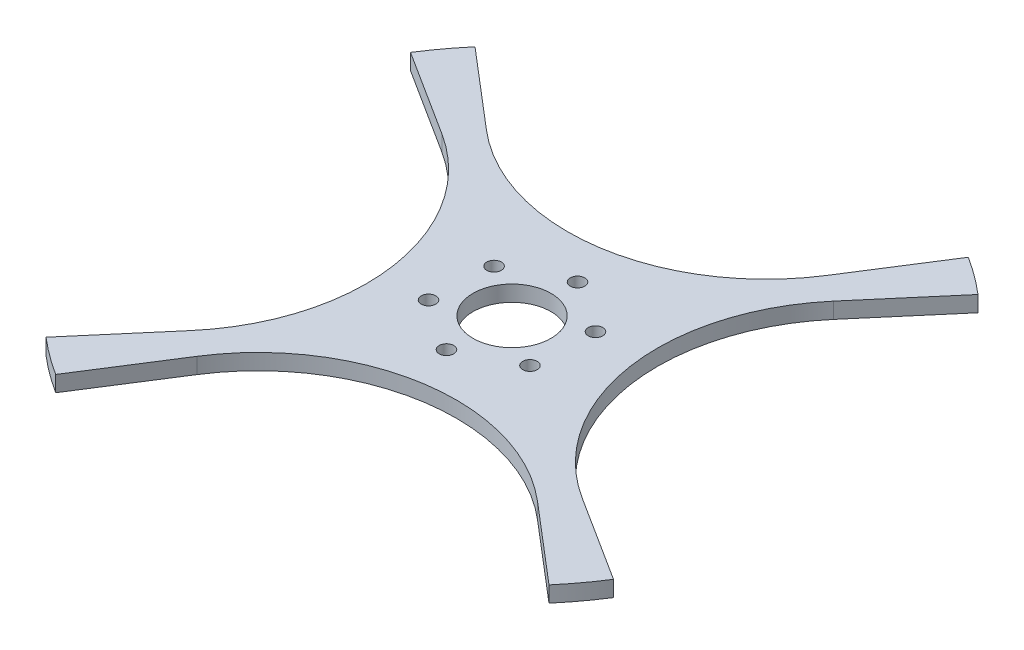
ISO-10303-21;
HEADER;
FILE_DESCRIPTION(('STEP AP214'),'2;1');
FILE_NAME('part.step','',(''),(''),'','','');
FILE_SCHEMA(('AUTOMOTIVE_DESIGN { 1 0 10303 214 1 1 1 1 }'));
ENDSEC;
DATA;
#1=APPLICATION_CONTEXT('core data for automotive mechanical design processes');
#2=APPLICATION_PROTOCOL_DEFINITION('international standard','automotive_design',2000,#1);
#3=PRODUCT_CONTEXT('',#1,'mechanical');
#4=PRODUCT('Part','Part','',(#3));
#5=PRODUCT_RELATED_PRODUCT_CATEGORY('part','',(#4));
#6=PRODUCT_DEFINITION_FORMATION('','',#4);
#7=PRODUCT_DEFINITION_CONTEXT('part definition',#1,'design');
#8=PRODUCT_DEFINITION('design','',#6,#7);
#9=PRODUCT_DEFINITION_SHAPE('','',#8);
#10=(LENGTH_UNIT() NAMED_UNIT(*) SI_UNIT(.MILLI.,.METRE.));
#11=(NAMED_UNIT(*) PLANE_ANGLE_UNIT() SI_UNIT($,.RADIAN.));
#12=(NAMED_UNIT(*) SI_UNIT($,.STERADIAN.) SOLID_ANGLE_UNIT());
#13=UNCERTAINTY_MEASURE_WITH_UNIT(LENGTH_MEASURE(1.E-05),#10,'distance_accuracy_value','');
#14=(GEOMETRIC_REPRESENTATION_CONTEXT(3) GLOBAL_UNCERTAINTY_ASSIGNED_CONTEXT((#13)) GLOBAL_UNIT_ASSIGNED_CONTEXT((#10,
#11,#12)) REPRESENTATION_CONTEXT('',''));
#15=CARTESIAN_POINT('',(0.,0.,0.));
#16=DIRECTION('',(0.,0.,1.));
#17=DIRECTION('',(1.,0.,0.));
#18=AXIS2_PLACEMENT_3D('',#15,#16,#17);
#19=CARTESIAN_POINT('',(0.,6.,0.));
#20=DIRECTION('',(0.,-1.,0.));
#21=DIRECTION('',(0.,0.,-1.));
#22=AXIS2_PLACEMENT_3D('',#19,#20,#21);
#23=CYLINDRICAL_SURFACE('',#22,125.);
#24=CARTESIAN_POINT('',(0.,6.,0.));
#25=DIRECTION('',(0.,1.,0.));
#26=DIRECTION('',(0.,0.,1.));
#27=AXIS2_PLACEMENT_3D('',#24,#25,#26);
#28=CIRCLE('',#27,125.);
#29=CARTESIAN_POINT('',(-95.1068903600789,6.,-81.1152230227836));
#30=VERTEX_POINT('',#29);
#31=CARTESIAN_POINT('',(-105.470373764041,6.,-67.0894943942311));
#32=VERTEX_POINT('',#31);
#33=EDGE_CURVE('E361',#30,#32,#28,.T.);
#34=ORIENTED_EDGE('',*,*,#33,.F.);
#35=DIRECTION('',(0.,1.,0.));
#36=VECTOR('',#35,1.);
#37=CARTESIAN_POINT('',(-95.1068903600789,0.,-81.1152230227836));
#38=LINE('',#37,#36);
#39=CARTESIAN_POINT('',(-95.1068903600789,0.,-81.1152230227836));
#40=VERTEX_POINT('',#39);
#41=EDGE_CURVE('E215',#40,#30,#38,.T.);
#42=ORIENTED_EDGE('',*,*,#41,.F.);
#43=CARTESIAN_POINT('',(0.,0.,0.));
#44=DIRECTION('',(0.,1.,0.));
#45=DIRECTION('',(0.,0.,1.));
#46=AXIS2_PLACEMENT_3D('',#43,#44,#45);
#47=CIRCLE('',#46,125.);
#48=CARTESIAN_POINT('',(-105.470373764041,0.,-67.0894943942311));
#49=VERTEX_POINT('',#48);
#50=EDGE_CURVE('E348',#40,#49,#47,.T.);
#51=ORIENTED_EDGE('',*,*,#50,.T.);
#52=DIRECTION('',(0.,1.,0.));
#53=VECTOR('',#52,1.);
#54=CARTESIAN_POINT('',(-105.470373764041,0.,-67.0894943942311));
#55=LINE('',#54,#53);
#56=EDGE_CURVE('E161',#49,#32,#55,.T.);
#57=ORIENTED_EDGE('',*,*,#56,.T.);
#58=EDGE_LOOP('',(#34,#42,#51,#57));
#59=FACE_BOUND('',#58,.T.);
#60=ADVANCED_FACE('F39',(#59),#23,.T.);
#61=CARTESIAN_POINT('',(-81.1152230227826,6.,95.1068903600798));
#62=VERTEX_POINT('',#61);
#63=CARTESIAN_POINT('',(-67.0894943942322,6.,105.47037376404));
#64=VERTEX_POINT('',#63);
#65=EDGE_CURVE('E49',#62,#64,#28,.T.);
#66=ORIENTED_EDGE('',*,*,#65,.F.);
#67=DIRECTION('',(0.,1.,0.));
#68=VECTOR('',#67,1.);
#69=CARTESIAN_POINT('',(-81.1152230227826,0.,95.1068903600798));
#70=LINE('',#69,#68);
#71=CARTESIAN_POINT('',(-81.1152230227826,0.,95.1068903600798));
#72=VERTEX_POINT('',#71);
#73=EDGE_CURVE('E188',#72,#62,#70,.T.);
#74=ORIENTED_EDGE('',*,*,#73,.F.);
#75=CARTESIAN_POINT('',(-67.0894943942322,0.,105.47037376404));
#76=VERTEX_POINT('',#75);
#77=EDGE_CURVE('E271',#72,#76,#47,.T.);
#78=ORIENTED_EDGE('',*,*,#77,.T.);
#79=DIRECTION('',(0.,1.,0.));
#80=VECTOR('',#79,1.);
#81=CARTESIAN_POINT('',(-67.0894943942322,0.,105.47037376404));
#82=LINE('',#81,#80);
#83=EDGE_CURVE('E268',#76,#64,#82,.T.);
#84=ORIENTED_EDGE('',*,*,#83,.T.);
#85=EDGE_LOOP('',(#66,#74,#78,#84));
#86=FACE_BOUND('',#85,.T.);
#87=ADVANCED_FACE('F312',(#86),#23,.T.);
#88=CARTESIAN_POINT('',(81.1152230227832,0.,-95.1068903600792));
#89=VERTEX_POINT('',#88);
#90=CARTESIAN_POINT('',(67.0894943942322,0.,-105.47037376404));
#91=VERTEX_POINT('',#90);
#92=EDGE_CURVE('E276',#89,#91,#47,.T.);
#93=ORIENTED_EDGE('',*,*,#92,.T.);
#94=DIRECTION('',(0.,1.,0.));
#95=VECTOR('',#94,1.);
#96=CARTESIAN_POINT('',(67.0894943942322,0.,-105.47037376404));
#97=LINE('',#96,#95);
#98=CARTESIAN_POINT('',(67.0894943942322,6.,-105.47037376404));
#99=VERTEX_POINT('',#98);
#100=EDGE_CURVE('E211',#91,#99,#97,.T.);
#101=ORIENTED_EDGE('',*,*,#100,.T.);
#102=CARTESIAN_POINT('',(81.1152230227832,6.,-95.1068903600792));
#103=VERTEX_POINT('',#102);
#104=EDGE_CURVE('E48',#103,#99,#28,.T.);
#105=ORIENTED_EDGE('',*,*,#104,.F.);
#106=DIRECTION('',(0.,1.,0.));
#107=VECTOR('',#106,1.);
#108=CARTESIAN_POINT('',(81.1152230227832,0.,-95.1068903600792));
#109=LINE('',#108,#107);
#110=EDGE_CURVE('E240',#89,#103,#109,.T.);
#111=ORIENTED_EDGE('',*,*,#110,.F.);
#112=EDGE_LOOP('',(#93,#101,#105,#111));
#113=FACE_BOUND('',#112,.T.);
#114=ADVANCED_FACE('F316',(#113),#23,.T.);
#115=CARTESIAN_POINT('',(0.,6.,0.));
#116=DIRECTION('',(0.,1.,0.));
#117=DIRECTION('',(0.,0.,1.));
#118=AXIS2_PLACEMENT_3D('',#115,#116,#117);
#119=PLANE('',#118);
#120=CARTESIAN_POINT('',(-1.31342881130652,6.,23.4632671372269));
#121=DIRECTION('',(0.,1.,0.));
#122=DIRECTION('',(0.,0.,1.));
#123=AXIS2_PLACEMENT_3D('',#120,#121,#122);
#124=CIRCLE('',#123,2.7499999997307);
#125=CARTESIAN_POINT('',(-1.31342881130652,6.,26.2132671369576));
#126=VERTEX_POINT('',#125);
#127=EDGE_CURVE('E284',#126,#126,#124,.T.);
#128=ORIENTED_EDGE('',*,*,#127,.F.);
#129=EDGE_LOOP('',(#128));
#130=FACE_BOUND('',#129,.T.);
#131=CARTESIAN_POINT('',(-20.9764998022612,6.,10.5941708517577));
#132=DIRECTION('',(0.,1.,0.));
#133=DIRECTION('',(0.,0.,1.));
#134=AXIS2_PLACEMENT_3D('',#131,#132,#133);
#135=CIRCLE('',#134,2.74999999978807);
#136=CARTESIAN_POINT('',(-20.9764998022612,6.,13.3441708515457));
#137=VERTEX_POINT('',#136);
#138=EDGE_CURVE('E443',#137,#137,#135,.T.);
#139=ORIENTED_EDGE('',*,*,#138,.F.);
#140=EDGE_LOOP('',(#139));
#141=FACE_BOUND('',#140,.T.);
#142=CARTESIAN_POINT('',(-19.6630709907741,6.,-12.8690962855605));
#143=DIRECTION('',(0.,1.,0.));
#144=DIRECTION('',(0.,0.,1.));
#145=AXIS2_PLACEMENT_3D('',#142,#143,#144);
#146=CIRCLE('',#145,2.74999999985813);
#147=CARTESIAN_POINT('',(-19.6630709907741,6.,-10.1190962857024));
#148=VERTEX_POINT('',#147);
#149=EDGE_CURVE('E181',#148,#148,#146,.T.);
#150=ORIENTED_EDGE('',*,*,#149,.F.);
#151=EDGE_LOOP('',(#150));
#152=FACE_BOUND('',#151,.T.);
#153=CARTESIAN_POINT('',(1.31342881166756,6.,-23.4632671374095));
#154=DIRECTION('',(0.,1.,0.));
#155=DIRECTION('',(0.,0.,1.));
#156=AXIS2_PLACEMENT_3D('',#153,#154,#155);
#157=CIRCLE('',#156,2.74999999987083);
#158=CARTESIAN_POINT('',(1.31342881166756,6.,-20.7132671375386));
#159=VERTEX_POINT('',#158);
#160=EDGE_CURVE('E441',#159,#159,#157,.T.);
#161=ORIENTED_EDGE('',*,*,#160,.F.);
#162=EDGE_LOOP('',(#161));
#163=FACE_BOUND('',#162,.T.);
#164=CARTESIAN_POINT('',(20.9764998026222,6.,-10.5941708519402));
#165=DIRECTION('',(0.,1.,0.));
#166=DIRECTION('',(0.,0.,1.));
#167=AXIS2_PLACEMENT_3D('',#164,#165,#166);
#168=CIRCLE('',#167,2.74999999981347);
#169=CARTESIAN_POINT('',(20.9764998026222,6.,-7.8441708521267));
#170=VERTEX_POINT('',#169);
#171=EDGE_CURVE('E440',#170,#170,#168,.T.);
#172=ORIENTED_EDGE('',*,*,#171,.F.);
#173=EDGE_LOOP('',(#172));
#174=FACE_BOUND('',#173,.T.);
#175=CARTESIAN_POINT('',(19.6630709911351,6.,12.869096285378));
#176=DIRECTION('',(0.,1.,0.));
#177=DIRECTION('',(0.,0.,1.));
#178=AXIS2_PLACEMENT_3D('',#175,#176,#177);
#179=CIRCLE('',#178,2.7499999997434);
#180=CARTESIAN_POINT('',(19.6630709911351,6.,15.6190962851214));
#181=VERTEX_POINT('',#180);
#182=EDGE_CURVE('E433',#181,#181,#179,.T.);
#183=ORIENTED_EDGE('',*,*,#182,.F.);
#184=EDGE_LOOP('',(#183));
#185=FACE_BOUND('',#184,.T.);
#186=DIRECTION('',(0.536715955153844,0.,-0.843762990112328));
#187=VECTOR('',#186,1.);
#188=CARTESIAN_POINT('',(46.3065808845338,6.,-72.7978715255653));
#189=LINE('',#188,#187);
#190=CARTESIAN_POINT('',(46.3065808845338,6.,-72.7978715255653));
#191=VERTEX_POINT('',#190);
#192=EDGE_CURVE('E63',#191,#99,#189,.T.);
#193=ORIENTED_EDGE('',*,*,#192,.F.);
#194=CARTESIAN_POINT('',(-16.97564337389,6.,-113.051568162105));
#195=DIRECTION('',(0.,1.,0.));
#196=DIRECTION('',(0.,0.,-1.));
#197=AXIS2_PLACEMENT_3D('',#194,#195,#196);
#198=CIRCLE('',#197,75.);
#199=CARTESIAN_POINT('',(-65.6447771875601,6.,-55.9874339460577));
#200=VERTEX_POINT('',#199);
#201=EDGE_CURVE('E186',#200,#191,#198,.T.);
#202=ORIENTED_EDGE('',*,*,#201,.F.);
#203=DIRECTION('',(0.760855122880631,0.,0.648921784182269));
#204=VECTOR('',#203,1.);
#205=CARTESIAN_POINT('',(-65.6447771875601,6.,-55.9874339460577));
#206=LINE('',#205,#204);
#207=EDGE_CURVE('E200',#30,#200,#206,.T.);
#208=ORIENTED_EDGE('',*,*,#207,.F.);
#209=ORIENTED_EDGE('',*,*,#33,.T.);
#210=DIRECTION('',(-0.843762990112334,0.,-0.536715955153835));
#211=VECTOR('',#210,1.);
#212=CARTESIAN_POINT('',(-72.7978715255658,6.,-46.306580884533));
#213=LINE('',#212,#211);
#214=CARTESIAN_POINT('',(-72.7978715255658,6.,-46.306580884533));
#215=VERTEX_POINT('',#214);
#216=EDGE_CURVE('E60',#215,#32,#213,.T.);
#217=ORIENTED_EDGE('',*,*,#216,.F.);
#218=CARTESIAN_POINT('',(-113.051568162105,6.,16.9756433738911));
#219=DIRECTION('',(0.,1.,0.));
#220=DIRECTION('',(-1.,0.,0.));
#221=AXIS2_PLACEMENT_3D('',#218,#219,#220);
#222=CIRCLE('',#221,75.);
#223=CARTESIAN_POINT('',(-55.987433946057,6.,65.6447771875607));
#224=VERTEX_POINT('',#223);
#225=EDGE_CURVE('E162',#224,#215,#222,.T.);
#226=ORIENTED_EDGE('',*,*,#225,.F.);
#227=DIRECTION('',(0.648921784182261,0.,-0.760855122880638));
#228=VECTOR('',#227,1.);
#229=CARTESIAN_POINT('',(-55.987433946057,6.,65.6447771875607));
#230=LINE('',#229,#228);
#231=EDGE_CURVE('E176',#62,#224,#230,.T.);
#232=ORIENTED_EDGE('',*,*,#231,.F.);
#233=ORIENTED_EDGE('',*,*,#65,.T.);
#234=DIRECTION('',(-0.536715955153844,0.,0.843762990112328));
#235=VECTOR('',#234,1.);
#236=CARTESIAN_POINT('',(-46.3065808845338,6.,72.7978715255653));
#237=LINE('',#236,#235);
#238=CARTESIAN_POINT('',(-46.3065808845338,6.,72.7978715255653));
#239=VERTEX_POINT('',#238);
#240=EDGE_CURVE('E257',#239,#64,#237,.T.);
#241=ORIENTED_EDGE('',*,*,#240,.F.);
#242=CARTESIAN_POINT('',(16.97564337389,6.,113.051568162105));
#243=DIRECTION('',(0.,1.,0.));
#244=DIRECTION('',(0.,0.,1.));
#245=AXIS2_PLACEMENT_3D('',#242,#243,#244);
#246=CIRCLE('',#245,75.);
#247=CARTESIAN_POINT('',(65.6447771875601,6.,55.9874339460577));
#248=VERTEX_POINT('',#247);
#249=EDGE_CURVE('E236',#248,#239,#246,.T.);
#250=ORIENTED_EDGE('',*,*,#249,.F.);
#251=DIRECTION('',(-0.760855122880631,0.,-0.648921784182269));
#252=VECTOR('',#251,1.);
#253=CARTESIAN_POINT('',(65.6447771875601,6.,55.9874339460577));
#254=LINE('',#253,#252);
#255=CARTESIAN_POINT('',(95.1068903600789,6.,81.1152230227836));
#256=VERTEX_POINT('',#255);
#257=EDGE_CURVE('E250',#256,#248,#254,.T.);
#258=ORIENTED_EDGE('',*,*,#257,.F.);
#259=CARTESIAN_POINT('',(105.47037376404,6.,67.0894943942318));
#260=VERTEX_POINT('',#259);
#261=EDGE_CURVE('E11',#256,#260,#28,.T.);
#262=ORIENTED_EDGE('',*,*,#261,.T.);
#263=DIRECTION('',(0.84376299011233,0.,0.536715955153841));
#264=VECTOR('',#263,1.);
#265=CARTESIAN_POINT('',(72.7978715255655,6.,46.3065808845335));
#266=LINE('',#265,#264);
#267=CARTESIAN_POINT('',(72.7978715255655,6.,46.3065808845335));
#268=VERTEX_POINT('',#267);
#269=EDGE_CURVE('E229',#268,#260,#266,.T.);
#270=ORIENTED_EDGE('',*,*,#269,.F.);
#271=CARTESIAN_POINT('',(113.051568162105,6.,-16.9756433738904));
#272=DIRECTION('',(0.,1.,0.));
#273=DIRECTION('',(1.,0.,0.));
#274=AXIS2_PLACEMENT_3D('',#271,#272,#273);
#275=CIRCLE('',#274,75.);
#276=CARTESIAN_POINT('',(55.9874339460574,6.,-65.6447771875603));
#277=VERTEX_POINT('',#276);
#278=EDGE_CURVE('E212',#277,#268,#275,.T.);
#279=ORIENTED_EDGE('',*,*,#278,.F.);
#280=DIRECTION('',(-0.648921784182267,0.,0.760855122880634));
#281=VECTOR('',#280,1.);
#282=CARTESIAN_POINT('',(55.9874339460574,6.,-65.6447771875603));
#283=LINE('',#282,#281);
#284=EDGE_CURVE('E223',#103,#277,#283,.T.);
#285=ORIENTED_EDGE('',*,*,#284,.F.);
#286=ORIENTED_EDGE('',*,*,#104,.T.);
#287=EDGE_LOOP('',(#193,#202,#208,#209,#217,#226,#232,#233,#241,#250,#258,#262,#270,#279,#285,#286));
#288=FACE_BOUND('',#287,.T.);
#289=CARTESIAN_POINT('',(0.,6.,0.));
#290=DIRECTION('',(0.,1.,0.));
#291=DIRECTION('',(0.,0.,1.));
#292=AXIS2_PLACEMENT_3D('',#289,#290,#291);
#293=CIRCLE('',#292,14.75);
#294=CARTESIAN_POINT('',(0.,6.,14.75));
#295=VERTEX_POINT('',#294);
#296=EDGE_CURVE('E266',#295,#295,#293,.T.);
#297=ORIENTED_EDGE('',*,*,#296,.F.);
#298=EDGE_LOOP('',(#297));
#299=FACE_BOUND('',#298,.T.);
#300=ADVANCED_FACE('F335',(#130,#141,#152,#163,#174,#185,#288,#299),#119,.T.);
#301=CARTESIAN_POINT('',(0.,0.,0.));
#302=DIRECTION('',(0.,1.,0.));
#303=DIRECTION('',(0.,0.,1.));
#304=AXIS2_PLACEMENT_3D('',#301,#302,#303);
#305=PLANE('',#304);
#306=CARTESIAN_POINT('',(-1.31342881130652,0.,23.4632671372269));
#307=DIRECTION('',(0.,1.,0.));
#308=DIRECTION('',(0.,0.,1.));
#309=AXIS2_PLACEMENT_3D('',#306,#307,#308);
#310=CIRCLE('',#309,2.7499999997307);
#311=CARTESIAN_POINT('',(-1.31342881130652,0.,26.2132671369576));
#312=VERTEX_POINT('',#311);
#313=EDGE_CURVE('E43',#312,#312,#310,.T.);
#314=ORIENTED_EDGE('',*,*,#313,.T.);
#315=EDGE_LOOP('',(#314));
#316=FACE_BOUND('',#315,.T.);
#317=CARTESIAN_POINT('',(-20.9764998022612,0.,10.5941708517577));
#318=DIRECTION('',(0.,1.,0.));
#319=DIRECTION('',(0.,0.,1.));
#320=AXIS2_PLACEMENT_3D('',#317,#318,#319);
#321=CIRCLE('',#320,2.74999999978807);
#322=CARTESIAN_POINT('',(-20.9764998022612,0.,13.3441708515457));
#323=VERTEX_POINT('',#322);
#324=EDGE_CURVE('E292',#323,#323,#321,.T.);
#325=ORIENTED_EDGE('',*,*,#324,.T.);
#326=EDGE_LOOP('',(#325));
#327=FACE_BOUND('',#326,.T.);
#328=CARTESIAN_POINT('',(-19.6630709907741,0.,-12.8690962855605));
#329=DIRECTION('',(0.,1.,0.));
#330=DIRECTION('',(0.,0.,1.));
#331=AXIS2_PLACEMENT_3D('',#328,#329,#330);
#332=CIRCLE('',#331,2.74999999985813);
#333=CARTESIAN_POINT('',(-19.6630709907741,0.,-10.1190962857024));
#334=VERTEX_POINT('',#333);
#335=EDGE_CURVE('E286',#334,#334,#332,.T.);
#336=ORIENTED_EDGE('',*,*,#335,.T.);
#337=EDGE_LOOP('',(#336));
#338=FACE_BOUND('',#337,.T.);
#339=CARTESIAN_POINT('',(1.31342881166756,0.,-23.4632671374095));
#340=DIRECTION('',(0.,1.,0.));
#341=DIRECTION('',(0.,0.,1.));
#342=AXIS2_PLACEMENT_3D('',#339,#340,#341);
#343=CIRCLE('',#342,2.74999999987083);
#344=CARTESIAN_POINT('',(1.31342881166756,0.,-20.7132671375386));
#345=VERTEX_POINT('',#344);
#346=EDGE_CURVE('E289',#345,#345,#343,.T.);
#347=ORIENTED_EDGE('',*,*,#346,.T.);
#348=EDGE_LOOP('',(#347));
#349=FACE_BOUND('',#348,.T.);
#350=CARTESIAN_POINT('',(20.9764998026222,0.,-10.5941708519402));
#351=DIRECTION('',(0.,1.,0.));
#352=DIRECTION('',(0.,0.,1.));
#353=AXIS2_PLACEMENT_3D('',#350,#351,#352);
#354=CIRCLE('',#353,2.74999999981347);
#355=CARTESIAN_POINT('',(20.9764998026222,0.,-7.8441708521267));
#356=VERTEX_POINT('',#355);
#357=EDGE_CURVE('E281',#356,#356,#354,.T.);
#358=ORIENTED_EDGE('',*,*,#357,.T.);
#359=EDGE_LOOP('',(#358));
#360=FACE_BOUND('',#359,.T.);
#361=CARTESIAN_POINT('',(19.6630709911351,0.,12.869096285378));
#362=DIRECTION('',(0.,1.,0.));
#363=DIRECTION('',(0.,0.,1.));
#364=AXIS2_PLACEMENT_3D('',#361,#362,#363);
#365=CIRCLE('',#364,2.7499999997434);
#366=CARTESIAN_POINT('',(19.6630709911351,0.,15.6190962851214));
#367=VERTEX_POINT('',#366);
#368=EDGE_CURVE('E278',#367,#367,#365,.T.);
#369=ORIENTED_EDGE('',*,*,#368,.T.);
#370=EDGE_LOOP('',(#369));
#371=FACE_BOUND('',#370,.T.);
#372=ORIENTED_EDGE('',*,*,#50,.F.);
#373=DIRECTION('',(0.760855122880631,0.,0.648921784182269));
#374=VECTOR('',#373,1.);
#375=CARTESIAN_POINT('',(-65.6447771875601,0.,-55.9874339460577));
#376=LINE('',#375,#374);
#377=CARTESIAN_POINT('',(-65.6447771875601,0.,-55.9874339460577));
#378=VERTEX_POINT('',#377);
#379=EDGE_CURVE('E197',#40,#378,#376,.T.);
#380=ORIENTED_EDGE('',*,*,#379,.T.);
#381=CARTESIAN_POINT('',(-16.97564337389,0.,-113.051568162105));
#382=DIRECTION('',(0.,1.,0.));
#383=DIRECTION('',(0.,0.,-1.));
#384=AXIS2_PLACEMENT_3D('',#381,#382,#383);
#385=CIRCLE('',#384,75.);
#386=CARTESIAN_POINT('',(46.3065808845338,0.,-72.7978715255653));
#387=VERTEX_POINT('',#386);
#388=EDGE_CURVE('E194',#378,#387,#385,.T.);
#389=ORIENTED_EDGE('',*,*,#388,.T.);
#390=DIRECTION('',(0.536715955153844,0.,-0.843762990112328));
#391=VECTOR('',#390,1.);
#392=CARTESIAN_POINT('',(46.3065808845338,0.,-72.7978715255653));
#393=LINE('',#392,#391);
#394=EDGE_CURVE('E198',#387,#91,#393,.T.);
#395=ORIENTED_EDGE('',*,*,#394,.T.);
#396=ORIENTED_EDGE('',*,*,#92,.F.);
#397=DIRECTION('',(-0.648921784182267,0.,0.760855122880634));
#398=VECTOR('',#397,1.);
#399=CARTESIAN_POINT('',(55.9874339460574,0.,-65.6447771875603));
#400=LINE('',#399,#398);
#401=CARTESIAN_POINT('',(55.9874339460574,0.,-65.6447771875603));
#402=VERTEX_POINT('',#401);
#403=EDGE_CURVE('E225',#89,#402,#400,.T.);
#404=ORIENTED_EDGE('',*,*,#403,.T.);
#405=CARTESIAN_POINT('',(113.051568162105,0.,-16.9756433738904));
#406=DIRECTION('',(0.,1.,0.));
#407=DIRECTION('',(1.,0.,0.));
#408=AXIS2_PLACEMENT_3D('',#405,#406,#407);
#409=CIRCLE('',#408,75.);
#410=CARTESIAN_POINT('',(72.7978715255655,0.,46.3065808845335));
#411=VERTEX_POINT('',#410);
#412=EDGE_CURVE('E220',#402,#411,#409,.T.);
#413=ORIENTED_EDGE('',*,*,#412,.T.);
#414=DIRECTION('',(0.84376299011233,0.,0.536715955153841));
#415=VECTOR('',#414,1.);
#416=CARTESIAN_POINT('',(72.7978715255655,0.,46.3065808845335));
#417=LINE('',#416,#415);
#418=CARTESIAN_POINT('',(105.47037376404,0.,67.0894943942318));
#419=VERTEX_POINT('',#418);
#420=EDGE_CURVE('E217',#411,#419,#417,.T.);
#421=ORIENTED_EDGE('',*,*,#420,.T.);
#422=CARTESIAN_POINT('',(95.1068903600789,0.,81.1152230227836));
#423=VERTEX_POINT('',#422);
#424=EDGE_CURVE('E277',#423,#419,#47,.T.);
#425=ORIENTED_EDGE('',*,*,#424,.F.);
#426=DIRECTION('',(-0.760855122880631,0.,-0.648921784182269));
#427=VECTOR('',#426,1.);
#428=CARTESIAN_POINT('',(65.6447771875601,0.,55.9874339460577));
#429=LINE('',#428,#427);
#430=CARTESIAN_POINT('',(65.6447771875601,0.,55.9874339460577));
#431=VERTEX_POINT('',#430);
#432=EDGE_CURVE('E249',#423,#431,#429,.T.);
#433=ORIENTED_EDGE('',*,*,#432,.T.);
#434=CARTESIAN_POINT('',(16.97564337389,0.,113.051568162105));
#435=DIRECTION('',(0.,1.,0.));
#436=DIRECTION('',(0.,0.,1.));
#437=AXIS2_PLACEMENT_3D('',#434,#435,#436);
#438=CIRCLE('',#437,75.);
#439=CARTESIAN_POINT('',(-46.3065808845338,0.,72.7978715255653));
#440=VERTEX_POINT('',#439);
#441=EDGE_CURVE('E243',#431,#440,#438,.T.);
#442=ORIENTED_EDGE('',*,*,#441,.T.);
#443=DIRECTION('',(-0.536715955153844,0.,0.843762990112328));
#444=VECTOR('',#443,1.);
#445=CARTESIAN_POINT('',(-46.3065808845338,0.,72.7978715255653));
#446=LINE('',#445,#444);
#447=EDGE_CURVE('E246',#440,#76,#446,.T.);
#448=ORIENTED_EDGE('',*,*,#447,.T.);
#449=ORIENTED_EDGE('',*,*,#77,.F.);
#450=DIRECTION('',(0.648921784182261,0.,-0.760855122880638));
#451=VECTOR('',#450,1.);
#452=CARTESIAN_POINT('',(-55.987433946057,0.,65.6447771875607));
#453=LINE('',#452,#451);
#454=CARTESIAN_POINT('',(-55.987433946057,0.,65.6447771875607));
#455=VERTEX_POINT('',#454);
#456=EDGE_CURVE('E165',#72,#455,#453,.T.);
#457=ORIENTED_EDGE('',*,*,#456,.T.);
#458=CARTESIAN_POINT('',(-113.051568162105,0.,16.9756433738911));
#459=DIRECTION('',(0.,1.,0.));
#460=DIRECTION('',(-1.,0.,0.));
#461=AXIS2_PLACEMENT_3D('',#458,#459,#460);
#462=CIRCLE('',#461,75.);
#463=CARTESIAN_POINT('',(-72.7978715255658,0.,-46.306580884533));
#464=VERTEX_POINT('',#463);
#465=EDGE_CURVE('E160',#455,#464,#462,.T.);
#466=ORIENTED_EDGE('',*,*,#465,.T.);
#467=DIRECTION('',(-0.843762990112334,0.,-0.536715955153835));
#468=VECTOR('',#467,1.);
#469=CARTESIAN_POINT('',(-72.7978715255658,0.,-46.306580884533));
#470=LINE('',#469,#468);
#471=EDGE_CURVE('E170',#464,#49,#470,.T.);
#472=ORIENTED_EDGE('',*,*,#471,.T.);
#473=EDGE_LOOP('',(#372,#380,#389,#395,#396,#404,#413,#421,#425,#433,#442,#448,#449,#457,#466,#472));
#474=FACE_BOUND('',#473,.T.);
#475=CARTESIAN_POINT('',(0.,0.,0.));
#476=DIRECTION('',(0.,1.,0.));
#477=DIRECTION('',(0.,0.,1.));
#478=AXIS2_PLACEMENT_3D('',#475,#476,#477);
#479=CIRCLE('',#478,14.75);
#480=CARTESIAN_POINT('',(0.,0.,14.75));
#481=VERTEX_POINT('',#480);
#482=EDGE_CURVE('E261',#481,#481,#479,.T.);
#483=ORIENTED_EDGE('',*,*,#482,.T.);
#484=EDGE_LOOP('',(#483));
#485=FACE_BOUND('',#484,.T.);
#486=ADVANCED_FACE('F173',(#316,#327,#338,#349,#360,#371,#474,#485),#305,.F.);
#487=ORIENTED_EDGE('',*,*,#424,.T.);
#488=DIRECTION('',(0.,1.,0.));
#489=VECTOR('',#488,1.);
#490=CARTESIAN_POINT('',(105.47037376404,0.,67.0894943942318));
#491=LINE('',#490,#489);
#492=EDGE_CURVE('E237',#419,#260,#491,.T.);
#493=ORIENTED_EDGE('',*,*,#492,.T.);
#494=ORIENTED_EDGE('',*,*,#261,.F.);
#495=DIRECTION('',(0.,1.,0.));
#496=VECTOR('',#495,1.);
#497=CARTESIAN_POINT('',(95.1068903600789,0.,81.1152230227836));
#498=LINE('',#497,#496);
#499=EDGE_CURVE('E264',#423,#256,#498,.T.);
#500=ORIENTED_EDGE('',*,*,#499,.F.);
#501=EDGE_LOOP('',(#487,#493,#494,#500));
#502=FACE_BOUND('',#501,.T.);
#503=ADVANCED_FACE('F41',(#502),#23,.T.);
#504=CARTESIAN_POINT('',(0.,6.,0.));
#505=DIRECTION('',(0.,-1.,0.));
#506=DIRECTION('',(0.,0.,-1.));
#507=AXIS2_PLACEMENT_3D('',#504,#505,#506);
#508=CYLINDRICAL_SURFACE('',#507,14.75);
#509=ORIENTED_EDGE('',*,*,#296,.T.);
#510=EDGE_LOOP('',(#509));
#511=FACE_BOUND('',#510,.T.);
#512=ORIENTED_EDGE('',*,*,#482,.F.);
#513=EDGE_LOOP('',(#512));
#514=FACE_BOUND('',#513,.T.);
#515=ADVANCED_FACE('F324',(#511,#514),#508,.F.);
#516=CARTESIAN_POINT('',(16.97564337389,0.,113.051568162105));
#517=DIRECTION('',(0.,1.,0.));
#518=DIRECTION('',(0.,0.,1.));
#519=AXIS2_PLACEMENT_3D('',#516,#517,#518);
#520=CYLINDRICAL_SURFACE('',#519,75.);
#521=ORIENTED_EDGE('',*,*,#249,.T.);
#522=DIRECTION('',(0.,1.,0.));
#523=VECTOR('',#522,1.);
#524=CARTESIAN_POINT('',(-46.3065808845338,0.,72.7978715255653));
#525=LINE('',#524,#523);
#526=EDGE_CURVE('E254',#440,#239,#525,.T.);
#527=ORIENTED_EDGE('',*,*,#526,.F.);
#528=ORIENTED_EDGE('',*,*,#441,.F.);
#529=DIRECTION('',(0.,1.,0.));
#530=VECTOR('',#529,1.);
#531=CARTESIAN_POINT('',(65.6447771875601,0.,55.9874339460577));
#532=LINE('',#531,#530);
#533=EDGE_CURVE('E263',#431,#248,#532,.T.);
#534=ORIENTED_EDGE('',*,*,#533,.T.);
#535=EDGE_LOOP('',(#521,#527,#528,#534));
#536=FACE_BOUND('',#535,.T.);
#537=ADVANCED_FACE('F327',(#536),#520,.F.);
#538=CARTESIAN_POINT('',(65.6447771875601,0.,55.9874339460577));
#539=DIRECTION('',(0.648921784182269,0.,-0.760855122880631));
#540=DIRECTION('',(-0.760855122880631,0.,-0.648921784182269));
#541=AXIS2_PLACEMENT_3D('',#538,#539,#540);
#542=PLANE('',#541);
#543=ORIENTED_EDGE('',*,*,#257,.T.);
#544=ORIENTED_EDGE('',*,*,#533,.F.);
#545=ORIENTED_EDGE('',*,*,#432,.F.);
#546=ORIENTED_EDGE('',*,*,#499,.T.);
#547=EDGE_LOOP('',(#543,#544,#545,#546));
#548=FACE_BOUND('',#547,.T.);
#549=ADVANCED_FACE('F382',(#548),#542,.F.);
#550=CARTESIAN_POINT('',(-46.3065808845338,0.,72.7978715255653));
#551=DIRECTION('',(-0.843762990112328,0.,-0.536715955153844));
#552=DIRECTION('',(-0.536715955153844,0.,0.843762990112328));
#553=AXIS2_PLACEMENT_3D('',#550,#551,#552);
#554=PLANE('',#553);
#555=ORIENTED_EDGE('',*,*,#240,.T.);
#556=ORIENTED_EDGE('',*,*,#83,.F.);
#557=ORIENTED_EDGE('',*,*,#447,.F.);
#558=ORIENTED_EDGE('',*,*,#526,.T.);
#559=EDGE_LOOP('',(#555,#556,#557,#558));
#560=FACE_BOUND('',#559,.T.);
#561=ADVANCED_FACE('F352',(#560),#554,.F.);
#562=CARTESIAN_POINT('',(113.051568162105,0.,-16.9756433738904));
#563=DIRECTION('',(0.,1.,0.));
#564=DIRECTION('',(0.,0.,1.));
#565=AXIS2_PLACEMENT_3D('',#562,#563,#564);
#566=CYLINDRICAL_SURFACE('',#565,75.);
#567=ORIENTED_EDGE('',*,*,#278,.T.);
#568=DIRECTION('',(0.,1.,0.));
#569=VECTOR('',#568,1.);
#570=CARTESIAN_POINT('',(72.7978715255655,0.,46.3065808845335));
#571=LINE('',#570,#569);
#572=EDGE_CURVE('E227',#411,#268,#571,.T.);
#573=ORIENTED_EDGE('',*,*,#572,.F.);
#574=ORIENTED_EDGE('',*,*,#412,.F.);
#575=DIRECTION('',(0.,1.,0.));
#576=VECTOR('',#575,1.);
#577=CARTESIAN_POINT('',(55.9874339460574,0.,-65.6447771875603));
#578=LINE('',#577,#576);
#579=EDGE_CURVE('E234',#402,#277,#578,.T.);
#580=ORIENTED_EDGE('',*,*,#579,.T.);
#581=EDGE_LOOP('',(#567,#573,#574,#580));
#582=FACE_BOUND('',#581,.T.);
#583=ADVANCED_FACE('F374',(#582),#566,.F.);
#584=CARTESIAN_POINT('',(55.9874339460574,0.,-65.6447771875603));
#585=DIRECTION('',(-0.760855122880633,0.,-0.648921784182266));
#586=DIRECTION('',(-0.648921784182267,0.,0.760855122880634));
#587=AXIS2_PLACEMENT_3D('',#584,#585,#586);
#588=PLANE('',#587);
#589=ORIENTED_EDGE('',*,*,#284,.T.);
#590=ORIENTED_EDGE('',*,*,#579,.F.);
#591=ORIENTED_EDGE('',*,*,#403,.F.);
#592=ORIENTED_EDGE('',*,*,#110,.T.);
#593=EDGE_LOOP('',(#589,#590,#591,#592));
#594=FACE_BOUND('',#593,.T.);
#595=ADVANCED_FACE('F371',(#594),#588,.F.);
#596=CARTESIAN_POINT('',(72.7978715255655,0.,46.3065808845335));
#597=DIRECTION('',(-0.536715955153841,0.,0.84376299011233));
#598=DIRECTION('',(0.84376299011233,0.,0.536715955153841));
#599=AXIS2_PLACEMENT_3D('',#596,#597,#598);
#600=PLANE('',#599);
#601=ORIENTED_EDGE('',*,*,#269,.T.);
#602=ORIENTED_EDGE('',*,*,#492,.F.);
#603=ORIENTED_EDGE('',*,*,#420,.F.);
#604=ORIENTED_EDGE('',*,*,#572,.T.);
#605=EDGE_LOOP('',(#601,#602,#603,#604));
#606=FACE_BOUND('',#605,.T.);
#607=ADVANCED_FACE('F380',(#606),#600,.F.);
#608=CARTESIAN_POINT('',(-113.051568162105,0.,16.9756433738911));
#609=DIRECTION('',(0.,1.,0.));
#610=DIRECTION('',(0.,0.,1.));
#611=AXIS2_PLACEMENT_3D('',#608,#609,#610);
#612=CYLINDRICAL_SURFACE('',#611,75.);
#613=ORIENTED_EDGE('',*,*,#225,.T.);
#614=DIRECTION('',(0.,1.,0.));
#615=VECTOR('',#614,1.);
#616=CARTESIAN_POINT('',(-72.7978715255658,0.,-46.306580884533));
#617=LINE('',#616,#615);
#618=EDGE_CURVE('E152',#464,#215,#617,.T.);
#619=ORIENTED_EDGE('',*,*,#618,.F.);
#620=ORIENTED_EDGE('',*,*,#465,.F.);
#621=DIRECTION('',(0.,1.,0.));
#622=VECTOR('',#621,1.);
#623=CARTESIAN_POINT('',(-55.987433946057,0.,65.6447771875607));
#624=LINE('',#623,#622);
#625=EDGE_CURVE('E190',#455,#224,#624,.T.);
#626=ORIENTED_EDGE('',*,*,#625,.T.);
#627=EDGE_LOOP('',(#613,#619,#620,#626));
#628=FACE_BOUND('',#627,.T.);
#629=ADVANCED_FACE('F159',(#628),#612,.F.);
#630=CARTESIAN_POINT('',(-55.987433946057,0.,65.6447771875607));
#631=DIRECTION('',(0.760855122880638,0.,0.648921784182261));
#632=DIRECTION('',(0.648921784182261,0.,-0.760855122880638));
#633=AXIS2_PLACEMENT_3D('',#630,#631,#632);
#634=PLANE('',#633);
#635=ORIENTED_EDGE('',*,*,#231,.T.);
#636=ORIENTED_EDGE('',*,*,#625,.F.);
#637=ORIENTED_EDGE('',*,*,#456,.F.);
#638=ORIENTED_EDGE('',*,*,#73,.T.);
#639=EDGE_LOOP('',(#635,#636,#637,#638));
#640=FACE_BOUND('',#639,.T.);
#641=ADVANCED_FACE('F406',(#640),#634,.F.);
#642=CARTESIAN_POINT('',(-72.7978715255658,0.,-46.306580884533));
#643=DIRECTION('',(0.536715955153835,0.,-0.843762990112334));
#644=DIRECTION('',(-0.843762990112334,0.,-0.536715955153835));
#645=AXIS2_PLACEMENT_3D('',#642,#643,#644);
#646=PLANE('',#645);
#647=ORIENTED_EDGE('',*,*,#216,.T.);
#648=ORIENTED_EDGE('',*,*,#56,.F.);
#649=ORIENTED_EDGE('',*,*,#471,.F.);
#650=ORIENTED_EDGE('',*,*,#618,.T.);
#651=EDGE_LOOP('',(#647,#648,#649,#650));
#652=FACE_BOUND('',#651,.T.);
#653=ADVANCED_FACE('F166',(#652),#646,.F.);
#654=CARTESIAN_POINT('',(-16.97564337389,0.,-113.051568162105));
#655=DIRECTION('',(0.,1.,0.));
#656=DIRECTION('',(0.,0.,1.));
#657=AXIS2_PLACEMENT_3D('',#654,#655,#656);
#658=CYLINDRICAL_SURFACE('',#657,75.);
#659=ORIENTED_EDGE('',*,*,#201,.T.);
#660=DIRECTION('',(0.,1.,0.));
#661=VECTOR('',#660,1.);
#662=CARTESIAN_POINT('',(46.3065808845338,0.,-72.7978715255653));
#663=LINE('',#662,#661);
#664=EDGE_CURVE('E202',#387,#191,#663,.T.);
#665=ORIENTED_EDGE('',*,*,#664,.F.);
#666=ORIENTED_EDGE('',*,*,#388,.F.);
#667=DIRECTION('',(0.,1.,0.));
#668=VECTOR('',#667,1.);
#669=CARTESIAN_POINT('',(-65.6447771875601,0.,-55.9874339460577));
#670=LINE('',#669,#668);
#671=EDGE_CURVE('E209',#378,#200,#670,.T.);
#672=ORIENTED_EDGE('',*,*,#671,.T.);
#673=EDGE_LOOP('',(#659,#665,#666,#672));
#674=FACE_BOUND('',#673,.T.);
#675=ADVANCED_FACE('F392',(#674),#658,.F.);
#676=CARTESIAN_POINT('',(-65.6447771875601,0.,-55.9874339460577));
#677=DIRECTION('',(-0.648921784182269,0.,0.760855122880631));
#678=DIRECTION('',(0.760855122880631,0.,0.648921784182269));
#679=AXIS2_PLACEMENT_3D('',#676,#677,#678);
#680=PLANE('',#679);
#681=ORIENTED_EDGE('',*,*,#207,.T.);
#682=ORIENTED_EDGE('',*,*,#671,.F.);
#683=ORIENTED_EDGE('',*,*,#379,.F.);
#684=ORIENTED_EDGE('',*,*,#41,.T.);
#685=EDGE_LOOP('',(#681,#682,#683,#684));
#686=FACE_BOUND('',#685,.T.);
#687=ADVANCED_FACE('F397',(#686),#680,.F.);
#688=CARTESIAN_POINT('',(46.3065808845338,0.,-72.7978715255653));
#689=DIRECTION('',(0.843762990112328,0.,0.536715955153844));
#690=DIRECTION('',(0.536715955153844,0.,-0.843762990112328));
#691=AXIS2_PLACEMENT_3D('',#688,#689,#690);
#692=PLANE('',#691);
#693=ORIENTED_EDGE('',*,*,#192,.T.);
#694=ORIENTED_EDGE('',*,*,#100,.F.);
#695=ORIENTED_EDGE('',*,*,#394,.F.);
#696=ORIENTED_EDGE('',*,*,#664,.T.);
#697=EDGE_LOOP('',(#693,#694,#695,#696));
#698=FACE_BOUND('',#697,.T.);
#699=ADVANCED_FACE('F396',(#698),#692,.F.);
#700=CARTESIAN_POINT('',(19.6630709911351,-4.,12.869096285378));
#701=DIRECTION('',(0.,1.,0.));
#702=DIRECTION('',(0.,0.,1.));
#703=AXIS2_PLACEMENT_3D('',#700,#701,#702);
#704=CYLINDRICAL_SURFACE('',#703,2.7499999997434);
#705=ORIENTED_EDGE('',*,*,#182,.T.);
#706=EDGE_LOOP('',(#705));
#707=FACE_BOUND('',#706,.T.);
#708=ORIENTED_EDGE('',*,*,#368,.F.);
#709=EDGE_LOOP('',(#708));
#710=FACE_BOUND('',#709,.T.);
#711=ADVANCED_FACE('F401',(#707,#710),#704,.F.);
#712=CARTESIAN_POINT('',(20.9764998026222,-4.,-10.5941708519402));
#713=DIRECTION('',(0.,1.,0.));
#714=DIRECTION('',(0.,0.,1.));
#715=AXIS2_PLACEMENT_3D('',#712,#713,#714);
#716=CYLINDRICAL_SURFACE('',#715,2.74999999981347);
#717=ORIENTED_EDGE('',*,*,#171,.T.);
#718=EDGE_LOOP('',(#717));
#719=FACE_BOUND('',#718,.T.);
#720=ORIENTED_EDGE('',*,*,#357,.F.);
#721=EDGE_LOOP('',(#720));
#722=FACE_BOUND('',#721,.T.);
#723=ADVANCED_FACE('F423',(#719,#722),#716,.F.);
#724=CARTESIAN_POINT('',(1.31342881166756,-4.,-23.4632671374095));
#725=DIRECTION('',(0.,1.,0.));
#726=DIRECTION('',(0.,0.,1.));
#727=AXIS2_PLACEMENT_3D('',#724,#725,#726);
#728=CYLINDRICAL_SURFACE('',#727,2.74999999987083);
#729=ORIENTED_EDGE('',*,*,#160,.T.);
#730=EDGE_LOOP('',(#729));
#731=FACE_BOUND('',#730,.T.);
#732=ORIENTED_EDGE('',*,*,#346,.F.);
#733=EDGE_LOOP('',(#732));
#734=FACE_BOUND('',#733,.T.);
#735=ADVANCED_FACE('F419',(#731,#734),#728,.F.);
#736=CARTESIAN_POINT('',(-19.6630709907741,-4.,-12.8690962855605));
#737=DIRECTION('',(0.,1.,0.));
#738=DIRECTION('',(0.,0.,1.));
#739=AXIS2_PLACEMENT_3D('',#736,#737,#738);
#740=CYLINDRICAL_SURFACE('',#739,2.74999999985813);
#741=ORIENTED_EDGE('',*,*,#149,.T.);
#742=EDGE_LOOP('',(#741));
#743=FACE_BOUND('',#742,.T.);
#744=ORIENTED_EDGE('',*,*,#335,.F.);
#745=EDGE_LOOP('',(#744));
#746=FACE_BOUND('',#745,.T.);
#747=ADVANCED_FACE('F308',(#743,#746),#740,.F.);
#748=CARTESIAN_POINT('',(-20.9764998022612,-4.,10.5941708517577));
#749=DIRECTION('',(0.,1.,0.));
#750=DIRECTION('',(0.,0.,1.));
#751=AXIS2_PLACEMENT_3D('',#748,#749,#750);
#752=CYLINDRICAL_SURFACE('',#751,2.74999999978807);
#753=ORIENTED_EDGE('',*,*,#138,.T.);
#754=EDGE_LOOP('',(#753));
#755=FACE_BOUND('',#754,.T.);
#756=ORIENTED_EDGE('',*,*,#324,.F.);
#757=EDGE_LOOP('',(#756));
#758=FACE_BOUND('',#757,.T.);
#759=ADVANCED_FACE('F305',(#755,#758),#752,.F.);
#760=CARTESIAN_POINT('',(-1.31342881130652,-4.,23.4632671372269));
#761=DIRECTION('',(0.,1.,0.));
#762=DIRECTION('',(0.,0.,1.));
#763=AXIS2_PLACEMENT_3D('',#760,#761,#762);
#764=CYLINDRICAL_SURFACE('',#763,2.7499999997307);
#765=ORIENTED_EDGE('',*,*,#127,.T.);
#766=EDGE_LOOP('',(#765));
#767=FACE_BOUND('',#766,.T.);
#768=ORIENTED_EDGE('',*,*,#313,.F.);
#769=EDGE_LOOP('',(#768));
#770=FACE_BOUND('',#769,.T.);
#771=ADVANCED_FACE('F297',(#767,#770),#764,.F.);
#772=CLOSED_SHELL('',(#60,#87,#114,#300,#486,#503,#515,#537,#549,#561,#583,#595,#607,#629,#641,
#653,#675,#687,#699,#711,#723,#735,#747,#759,#771));
#773=MANIFOLD_SOLID_BREP('B2',#772);
#774=ADVANCED_BREP_SHAPE_REPRESENTATION('',(#18,#773),#14);
#775=SHAPE_DEFINITION_REPRESENTATION(#9,#774);
ENDSEC;
END-ISO-10303-21;
